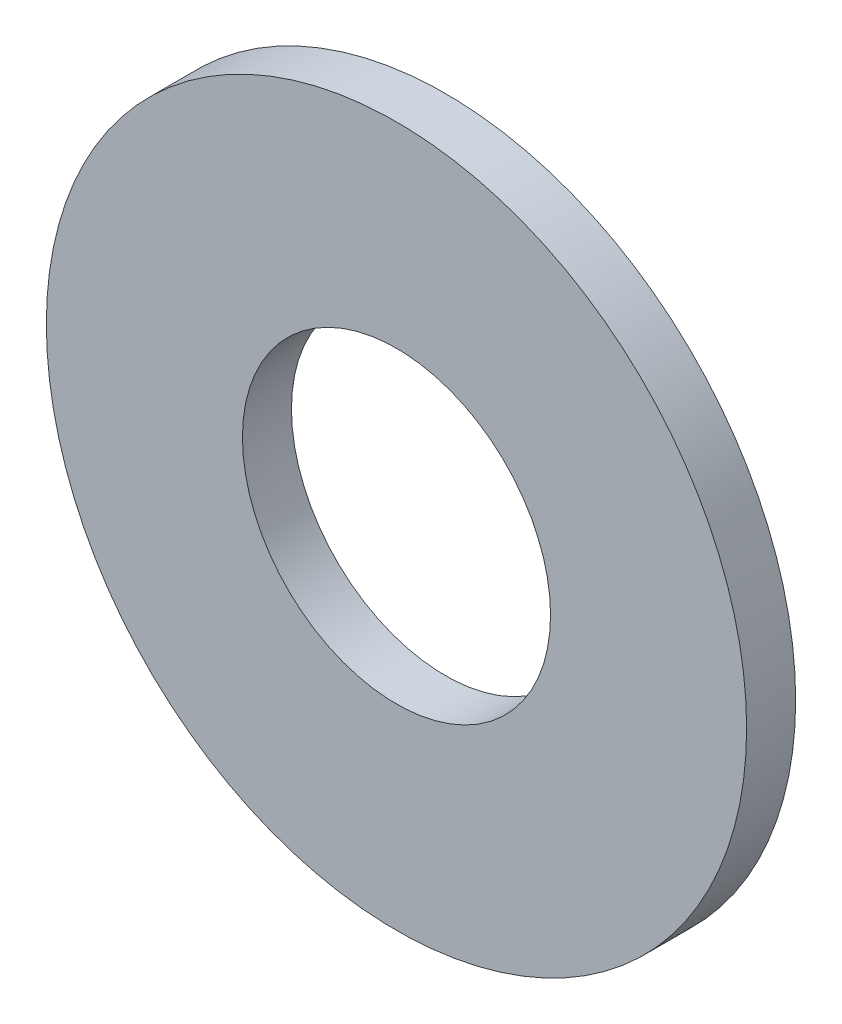
ISO-10303-21;
HEADER;
FILE_DESCRIPTION(('STEP AP214'),'2;1');
FILE_NAME('part.step','',(''),(''),'','','');
FILE_SCHEMA(('AUTOMOTIVE_DESIGN { 1 0 10303 214 1 1 1 1 }'));
ENDSEC;
DATA;
#1=APPLICATION_CONTEXT('core data for automotive mechanical design processes');
#2=APPLICATION_PROTOCOL_DEFINITION('international standard','automotive_design',2000,#1);
#3=PRODUCT_CONTEXT('',#1,'mechanical');
#4=PRODUCT('Part','Part','',(#3));
#5=PRODUCT_RELATED_PRODUCT_CATEGORY('part','',(#4));
#6=PRODUCT_DEFINITION_FORMATION('','',#4);
#7=PRODUCT_DEFINITION_CONTEXT('part definition',#1,'design');
#8=PRODUCT_DEFINITION('design','',#6,#7);
#9=PRODUCT_DEFINITION_SHAPE('','',#8);
#10=(LENGTH_UNIT() NAMED_UNIT(*) SI_UNIT(.MILLI.,.METRE.));
#11=(NAMED_UNIT(*) PLANE_ANGLE_UNIT() SI_UNIT($,.RADIAN.));
#12=(NAMED_UNIT(*) SI_UNIT($,.STERADIAN.) SOLID_ANGLE_UNIT());
#13=UNCERTAINTY_MEASURE_WITH_UNIT(LENGTH_MEASURE(1.E-05),#10,'distance_accuracy_value','');
#14=(GEOMETRIC_REPRESENTATION_CONTEXT(3) GLOBAL_UNCERTAINTY_ASSIGNED_CONTEXT((#13)) GLOBAL_UNIT_ASSIGNED_CONTEXT((#10,
#11,#12)) REPRESENTATION_CONTEXT('',''));
#15=CARTESIAN_POINT('',(0.,0.,0.));
#16=DIRECTION('',(0.,0.,1.));
#17=DIRECTION('',(1.,0.,0.));
#18=AXIS2_PLACEMENT_3D('',#15,#16,#17);
#19=CARTESIAN_POINT('',(0.,0.,0.889));
#20=DIRECTION('',(0.,0.,1.));
#21=DIRECTION('',(1.,0.,0.));
#22=AXIS2_PLACEMENT_3D('',#19,#20,#21);
#23=PLANE('',#22);
#24=CARTESIAN_POINT('',(0.,0.,0.889));
#25=DIRECTION('',(0.,0.,1.));
#26=DIRECTION('',(1.,0.,0.));
#27=AXIS2_PLACEMENT_3D('',#24,#25,#26);
#28=CIRCLE('',#27,2.794);
#29=CARTESIAN_POINT('',(2.794,0.,0.889));
#30=VERTEX_POINT('',#29);
#31=EDGE_CURVE('E27',#30,#30,#28,.F.);
#32=ORIENTED_EDGE('',*,*,#31,.T.);
#33=EDGE_LOOP('',(#32));
#34=FACE_BOUND('',#33,.T.);
#35=CARTESIAN_POINT('',(0.,0.,0.889));
#36=DIRECTION('',(0.,0.,1.));
#37=DIRECTION('',(1.,0.,0.));
#38=AXIS2_PLACEMENT_3D('',#35,#36,#37);
#39=CIRCLE('',#38,6.35);
#40=CARTESIAN_POINT('',(6.35,0.,0.889));
#41=VERTEX_POINT('',#40);
#42=EDGE_CURVE('E18',#41,#41,#39,.F.);
#43=ORIENTED_EDGE('',*,*,#42,.F.);
#44=EDGE_LOOP('',(#43));
#45=FACE_BOUND('',#44,.T.);
#46=ADVANCED_FACE('F15',(#34,#45),#23,.T.);
#47=CARTESIAN_POINT('',(0.,0.,0.));
#48=DIRECTION('',(0.,0.,1.));
#49=DIRECTION('',(1.,0.,0.));
#50=AXIS2_PLACEMENT_3D('',#47,#48,#49);
#51=CYLINDRICAL_SURFACE('',#50,6.35);
#52=ORIENTED_EDGE('',*,*,#42,.T.);
#53=EDGE_LOOP('',(#52));
#54=FACE_BOUND('',#53,.T.);
#55=CARTESIAN_POINT('',(0.,0.,0.));
#56=DIRECTION('',(0.,0.,1.));
#57=DIRECTION('',(1.,0.,0.));
#58=AXIS2_PLACEMENT_3D('',#55,#56,#57);
#59=CIRCLE('',#58,6.35);
#60=CARTESIAN_POINT('',(6.35,0.,0.));
#61=VERTEX_POINT('',#60);
#62=EDGE_CURVE('E22',#61,#61,#59,.T.);
#63=ORIENTED_EDGE('',*,*,#62,.T.);
#64=EDGE_LOOP('',(#63));
#65=FACE_BOUND('',#64,.T.);
#66=ADVANCED_FACE('F35',(#54,#65),#51,.T.);
#67=CARTESIAN_POINT('',(0.,0.,0.));
#68=DIRECTION('',(0.,0.,1.));
#69=DIRECTION('',(1.,0.,0.));
#70=AXIS2_PLACEMENT_3D('',#67,#68,#69);
#71=CYLINDRICAL_SURFACE('',#70,2.794);
#72=ORIENTED_EDGE('',*,*,#31,.F.);
#73=EDGE_LOOP('',(#72));
#74=FACE_BOUND('',#73,.T.);
#75=CARTESIAN_POINT('',(0.,0.,0.));
#76=DIRECTION('',(0.,0.,1.));
#77=DIRECTION('',(1.,0.,0.));
#78=AXIS2_PLACEMENT_3D('',#75,#76,#77);
#79=CIRCLE('',#78,2.794);
#80=CARTESIAN_POINT('',(2.794,0.,0.));
#81=VERTEX_POINT('',#80);
#82=EDGE_CURVE('E10',#81,#81,#79,.F.);
#83=ORIENTED_EDGE('',*,*,#82,.T.);
#84=EDGE_LOOP('',(#83));
#85=FACE_BOUND('',#84,.T.);
#86=ADVANCED_FACE('F43',(#74,#85),#71,.F.);
#87=CARTESIAN_POINT('',(0.,0.,0.));
#88=DIRECTION('',(0.,0.,1.));
#89=DIRECTION('',(1.,0.,0.));
#90=AXIS2_PLACEMENT_3D('',#87,#88,#89);
#91=PLANE('',#90);
#92=ORIENTED_EDGE('',*,*,#82,.F.);
#93=EDGE_LOOP('',(#92));
#94=FACE_BOUND('',#93,.T.);
#95=ORIENTED_EDGE('',*,*,#62,.F.);
#96=EDGE_LOOP('',(#95));
#97=FACE_BOUND('',#96,.T.);
#98=ADVANCED_FACE('F44',(#94,#97),#91,.F.);
#99=CLOSED_SHELL('',(#46,#66,#86,#98));
#100=MANIFOLD_SOLID_BREP('B1',#99);
#101=ADVANCED_BREP_SHAPE_REPRESENTATION('',(#18,#100),#14);
#102=SHAPE_DEFINITION_REPRESENTATION(#9,#101);
ENDSEC;
END-ISO-10303-21;
